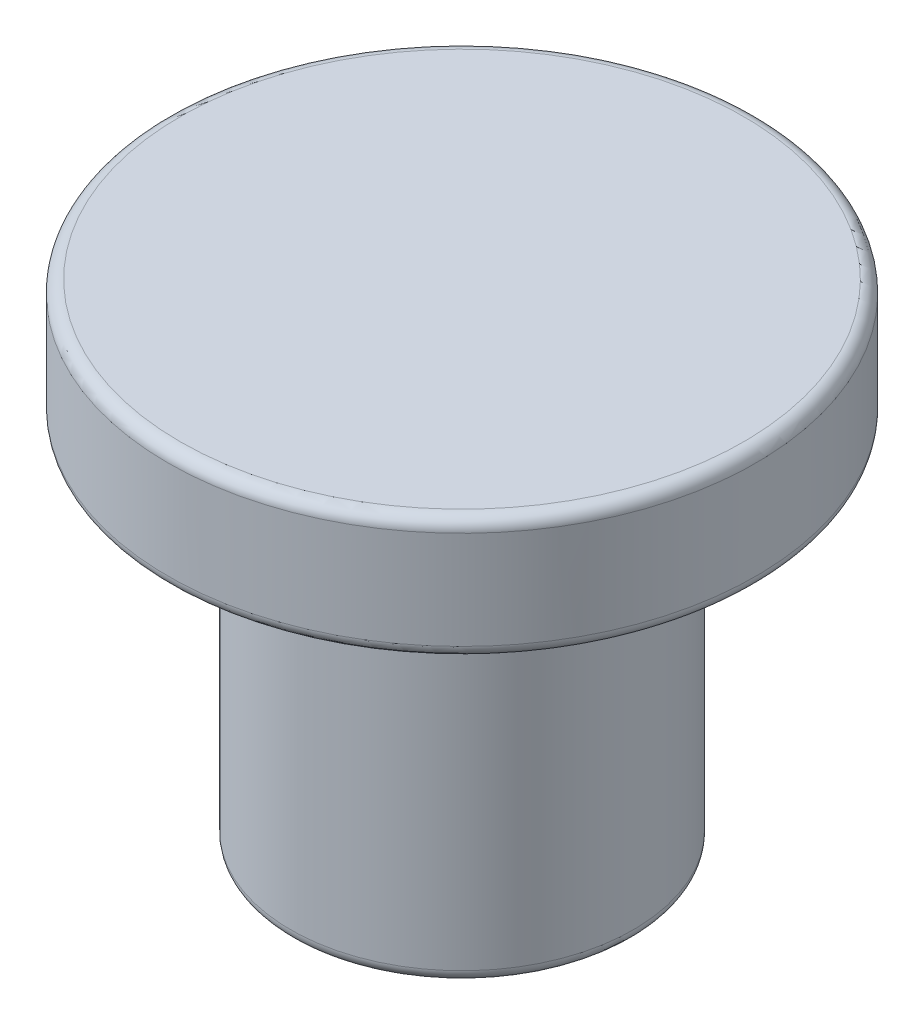
ISO-10303-21;
HEADER;
FILE_DESCRIPTION(('STEP AP214'),'2;1');
FILE_NAME('part.step','',(''),(''),'','','');
FILE_SCHEMA(('AUTOMOTIVE_DESIGN { 1 0 10303 214 1 1 1 1 }'));
ENDSEC;
DATA;
#1=APPLICATION_CONTEXT('core data for automotive mechanical design processes');
#2=APPLICATION_PROTOCOL_DEFINITION('international standard','automotive_design',2000,#1);
#3=PRODUCT_CONTEXT('',#1,'mechanical');
#4=PRODUCT('Part','Part','',(#3));
#5=PRODUCT_RELATED_PRODUCT_CATEGORY('part','',(#4));
#6=PRODUCT_DEFINITION_FORMATION('','',#4);
#7=PRODUCT_DEFINITION_CONTEXT('part definition',#1,'design');
#8=PRODUCT_DEFINITION('design','',#6,#7);
#9=PRODUCT_DEFINITION_SHAPE('','',#8);
#10=(LENGTH_UNIT() NAMED_UNIT(*) SI_UNIT(.MILLI.,.METRE.));
#11=(NAMED_UNIT(*) PLANE_ANGLE_UNIT() SI_UNIT($,.RADIAN.));
#12=(NAMED_UNIT(*) SI_UNIT($,.STERADIAN.) SOLID_ANGLE_UNIT());
#13=UNCERTAINTY_MEASURE_WITH_UNIT(LENGTH_MEASURE(1.E-05),#10,'distance_accuracy_value','');
#14=(GEOMETRIC_REPRESENTATION_CONTEXT(3) GLOBAL_UNCERTAINTY_ASSIGNED_CONTEXT((#13)) GLOBAL_UNIT_ASSIGNED_CONTEXT((#10,
#11,#12)) REPRESENTATION_CONTEXT('',''));
#15=CARTESIAN_POINT('',(0.,0.,0.));
#16=DIRECTION('',(0.,0.,1.));
#17=DIRECTION('',(1.,0.,0.));
#18=AXIS2_PLACEMENT_3D('',#15,#16,#17);
#19=CARTESIAN_POINT('',(7.,0.,0.));
#20=DIRECTION('',(0.,-1.,0.));
#21=DIRECTION('',(0.,0.,-1.));
#22=AXIS2_PLACEMENT_3D('',#19,#20,#21);
#23=PLANE('',#22);
#24=CARTESIAN_POINT('',(0.,0.,0.));
#25=DIRECTION('',(0.,-1.,0.));
#26=DIRECTION('',(0.,0.,-1.));
#27=AXIS2_PLACEMENT_3D('',#24,#25,#26);
#28=CIRCLE('',#27,6.5);
#29=CARTESIAN_POINT('',(0.,0.,-6.5));
#30=VERTEX_POINT('',#29);
#31=EDGE_CURVE('E35',#30,#30,#28,.T.);
#32=ORIENTED_EDGE('',*,*,#31,.T.);
#33=EDGE_LOOP('',(#32));
#34=FACE_BOUND('',#33,.T.);
#35=ADVANCED_FACE('F28',(#34),#23,.T.);
#36=CARTESIAN_POINT('',(0.,20.,0.));
#37=DIRECTION('',(0.,1.,0.));
#38=DIRECTION('',(0.,0.,1.));
#39=AXIS2_PLACEMENT_3D('',#36,#37,#38);
#40=PLANE('',#39);
#41=CARTESIAN_POINT('',(0.,20.,0.));
#42=DIRECTION('',(0.,1.,0.));
#43=DIRECTION('',(0.,0.,1.));
#44=AXIS2_PLACEMENT_3D('',#41,#42,#43);
#45=CIRCLE('',#44,11.5);
#46=CARTESIAN_POINT('',(0.,20.,11.5));
#47=VERTEX_POINT('',#46);
#48=EDGE_CURVE('E39',#47,#47,#45,.T.);
#49=ORIENTED_EDGE('',*,*,#48,.T.);
#50=EDGE_LOOP('',(#49));
#51=FACE_BOUND('',#50,.T.);
#52=ADVANCED_FACE('F71',(#51),#40,.T.);
#53=CARTESIAN_POINT('',(0.,0.,0.));
#54=DIRECTION('',(0.,-1.,0.));
#55=DIRECTION('',(0.,0.,-1.));
#56=AXIS2_PLACEMENT_3D('',#53,#54,#55);
#57=CYLINDRICAL_SURFACE('',#56,12.);
#58=CARTESIAN_POINT('',(0.,15.5,0.));
#59=DIRECTION('',(0.,-1.,0.));
#60=DIRECTION('',(0.,0.,-1.));
#61=AXIS2_PLACEMENT_3D('',#58,#59,#60);
#62=CIRCLE('',#61,12.);
#63=CARTESIAN_POINT('',(0.,15.5,-12.));
#64=VERTEX_POINT('',#63);
#65=EDGE_CURVE('E43',#64,#64,#62,.F.);
#66=ORIENTED_EDGE('',*,*,#65,.T.);
#67=EDGE_LOOP('',(#66));
#68=FACE_BOUND('',#67,.T.);
#69=CARTESIAN_POINT('',(0.,19.5,0.));
#70=DIRECTION('',(0.,1.,0.));
#71=DIRECTION('',(0.,0.,1.));
#72=AXIS2_PLACEMENT_3D('',#69,#70,#71);
#73=CIRCLE('',#72,12.);
#74=CARTESIAN_POINT('',(0.,19.5,12.));
#75=VERTEX_POINT('',#74);
#76=EDGE_CURVE('E48',#75,#75,#73,.F.);
#77=ORIENTED_EDGE('',*,*,#76,.T.);
#78=EDGE_LOOP('',(#77));
#79=FACE_BOUND('',#78,.T.);
#80=ADVANCED_FACE('F62',(#68,#79),#57,.T.);
#81=CARTESIAN_POINT('',(12.,15.,0.));
#82=DIRECTION('',(0.,-1.,0.));
#83=DIRECTION('',(0.,0.,-1.));
#84=AXIS2_PLACEMENT_3D('',#81,#82,#83);
#85=PLANE('',#84);
#86=CARTESIAN_POINT('',(0.,15.,0.));
#87=DIRECTION('',(0.,-1.,0.));
#88=DIRECTION('',(0.,0.,-1.));
#89=AXIS2_PLACEMENT_3D('',#86,#87,#88);
#90=CIRCLE('',#89,11.5);
#91=CARTESIAN_POINT('',(0.,15.,-11.5));
#92=VERTEX_POINT('',#91);
#93=EDGE_CURVE('E51',#92,#92,#90,.T.);
#94=ORIENTED_EDGE('',*,*,#93,.T.);
#95=EDGE_LOOP('',(#94));
#96=FACE_BOUND('',#95,.T.);
#97=CARTESIAN_POINT('',(0.,15.,0.));
#98=DIRECTION('',(0.,-1.,0.));
#99=DIRECTION('',(0.,0.,-1.));
#100=AXIS2_PLACEMENT_3D('',#97,#98,#99);
#101=CIRCLE('',#100,7.);
#102=CARTESIAN_POINT('',(0.,15.,-7.));
#103=VERTEX_POINT('',#102);
#104=EDGE_CURVE('E54',#103,#103,#101,.T.);
#105=ORIENTED_EDGE('',*,*,#104,.F.);
#106=EDGE_LOOP('',(#105));
#107=FACE_BOUND('',#106,.T.);
#108=ADVANCED_FACE('F60',(#96,#107),#85,.T.);
#109=CARTESIAN_POINT('',(0.,0.,0.));
#110=DIRECTION('',(0.,-1.,0.));
#111=DIRECTION('',(0.,0.,-1.));
#112=AXIS2_PLACEMENT_3D('',#109,#110,#111);
#113=CYLINDRICAL_SURFACE('',#112,7.);
#114=CARTESIAN_POINT('',(0.,0.499999999999999,0.));
#115=DIRECTION('',(0.,-1.,0.));
#116=DIRECTION('',(0.,0.,-1.));
#117=AXIS2_PLACEMENT_3D('',#114,#115,#116);
#118=CIRCLE('',#117,7.);
#119=CARTESIAN_POINT('',(0.,0.499999999999999,-7.));
#120=VERTEX_POINT('',#119);
#121=EDGE_CURVE('E10',#120,#120,#118,.F.);
#122=ORIENTED_EDGE('',*,*,#121,.T.);
#123=EDGE_LOOP('',(#122));
#124=FACE_BOUND('',#123,.T.);
#125=ORIENTED_EDGE('',*,*,#104,.T.);
#126=EDGE_LOOP('',(#125));
#127=FACE_BOUND('',#126,.T.);
#128=ADVANCED_FACE('F58',(#124,#127),#113,.T.);
#129=CARTESIAN_POINT('',(0.,15.5,0.));
#130=DIRECTION('',(0.,-1.,0.));
#131=DIRECTION('',(0.,0.,-1.));
#132=AXIS2_PLACEMENT_3D('',#129,#130,#131);
#133=TOROIDAL_SURFACE('',#132,11.5,0.5);
#134=ORIENTED_EDGE('',*,*,#65,.F.);
#135=EDGE_LOOP('',(#134));
#136=FACE_BOUND('',#135,.T.);
#137=ORIENTED_EDGE('',*,*,#93,.F.);
#138=EDGE_LOOP('',(#137));
#139=FACE_BOUND('',#138,.T.);
#140=ADVANCED_FACE('F69',(#136,#139),#133,.T.);
#141=CARTESIAN_POINT('',(0.,19.5,0.));
#142=DIRECTION('',(0.,1.,0.));
#143=DIRECTION('',(0.,0.,1.));
#144=AXIS2_PLACEMENT_3D('',#141,#142,#143);
#145=TOROIDAL_SURFACE('',#144,11.5,0.5);
#146=ORIENTED_EDGE('',*,*,#48,.F.);
#147=EDGE_LOOP('',(#146));
#148=FACE_BOUND('',#147,.T.);
#149=ORIENTED_EDGE('',*,*,#76,.F.);
#150=EDGE_LOOP('',(#149));
#151=FACE_BOUND('',#150,.T.);
#152=ADVANCED_FACE('F83',(#148,#151),#145,.T.);
#153=CARTESIAN_POINT('',(0.,0.499999999999999,0.));
#154=DIRECTION('',(0.,-1.,0.));
#155=DIRECTION('',(0.,0.,-1.));
#156=AXIS2_PLACEMENT_3D('',#153,#154,#155);
#157=TOROIDAL_SURFACE('',#156,6.5,0.5);
#158=ORIENTED_EDGE('',*,*,#121,.F.);
#159=EDGE_LOOP('',(#158));
#160=FACE_BOUND('',#159,.T.);
#161=ORIENTED_EDGE('',*,*,#31,.F.);
#162=EDGE_LOOP('',(#161));
#163=FACE_BOUND('',#162,.T.);
#164=ADVANCED_FACE('F30',(#160,#163),#157,.T.);
#165=CLOSED_SHELL('',(#35,#52,#80,#108,#128,#140,#152,#164));
#166=MANIFOLD_SOLID_BREP('B2',#165);
#167=ADVANCED_BREP_SHAPE_REPRESENTATION('',(#18,#166),#14);
#168=SHAPE_DEFINITION_REPRESENTATION(#9,#167);
ENDSEC;
END-ISO-10303-21;
